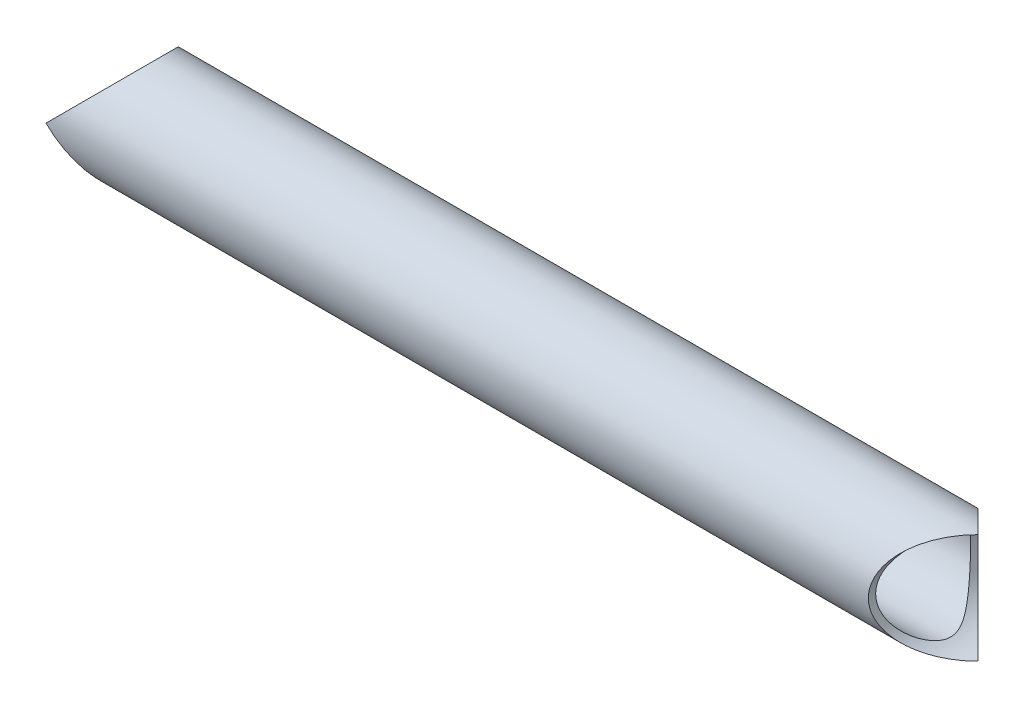
ISO-10303-21;
HEADER;
FILE_DESCRIPTION(('STEP AP214'),'2;1');
FILE_NAME('part.step','',(''),(''),'','','');
FILE_SCHEMA(('AUTOMOTIVE_DESIGN { 1 0 10303 214 1 1 1 1 }'));
ENDSEC;
DATA;
#1=APPLICATION_CONTEXT('core data for automotive mechanical design processes');
#2=APPLICATION_PROTOCOL_DEFINITION('international standard','automotive_design',2000,#1);
#3=PRODUCT_CONTEXT('',#1,'mechanical');
#4=PRODUCT('Part','Part','',(#3));
#5=PRODUCT_RELATED_PRODUCT_CATEGORY('part','',(#4));
#6=PRODUCT_DEFINITION_FORMATION('','',#4);
#7=PRODUCT_DEFINITION_CONTEXT('part definition',#1,'design');
#8=PRODUCT_DEFINITION('design','',#6,#7);
#9=PRODUCT_DEFINITION_SHAPE('','',#8);
#10=(LENGTH_UNIT() NAMED_UNIT(*) SI_UNIT(.MILLI.,.METRE.));
#11=(NAMED_UNIT(*) PLANE_ANGLE_UNIT() SI_UNIT($,.RADIAN.));
#12=(NAMED_UNIT(*) SI_UNIT($,.STERADIAN.) SOLID_ANGLE_UNIT());
#13=UNCERTAINTY_MEASURE_WITH_UNIT(LENGTH_MEASURE(1.E-05),#10,'distance_accuracy_value','');
#14=(GEOMETRIC_REPRESENTATION_CONTEXT(3) GLOBAL_UNCERTAINTY_ASSIGNED_CONTEXT((#13)) GLOBAL_UNIT_ASSIGNED_CONTEXT((#10,
#11,#12)) REPRESENTATION_CONTEXT('',''));
#15=CARTESIAN_POINT('',(0.,0.,0.));
#16=DIRECTION('',(0.,0.,1.));
#17=DIRECTION('',(1.,0.,0.));
#18=AXIS2_PLACEMENT_3D('',#15,#16,#17);
#19=CARTESIAN_POINT('',(0.,-50.7999999999999,-238.125));
#20=DIRECTION('',(0.,0.,1.));
#21=DIRECTION('',(1.,0.,0.));
#22=AXIS2_PLACEMENT_3D('',#19,#20,#21);
#23=CYLINDRICAL_SURFACE('',#22,9.52500000000001);
#24=CARTESIAN_POINT('',(0.,-50.7999999999999,0.));
#25=DIRECTION('',(0.707106781186547,0.,0.707106781186547));
#26=DIRECTION('',(0.707106781186547,0.,-0.707106781186547));
#27=AXIS2_PLACEMENT_3D('',#24,#25,#26);
#28=ELLIPSE('',#27,13.4703841816037,9.52500000000001);
#29=CARTESIAN_POINT('',(0.,-41.2749999999999,0.));
#30=VERTEX_POINT('',#29);
#31=CARTESIAN_POINT('',(0.,-60.3249999999999,0.));
#32=VERTEX_POINT('',#31);
#33=EDGE_CURVE('E52',#30,#32,#28,.T.);
#34=ORIENTED_EDGE('',*,*,#33,.T.);
#35=CARTESIAN_POINT('',(0.,-50.7999999999999,0.));
#36=DIRECTION('',(0.707106781186547,0.,-0.707106781186547));
#37=DIRECTION('',(0.707106781186547,0.,0.707106781186547));
#38=AXIS2_PLACEMENT_3D('',#35,#36,#37);
#39=ELLIPSE('',#38,13.4703841816037,9.52500000000001);
#40=EDGE_CURVE('E63',#32,#30,#39,.T.);
#41=ORIENTED_EDGE('',*,*,#40,.T.);
#42=EDGE_LOOP('',(#34,#41));
#43=FACE_BOUND('',#42,.T.);
#44=CARTESIAN_POINT('',(-9.52500000000001,-50.7999999999999,8.255));
#45=CARTESIAN_POINT('',(-9.5249991486296,-50.9937491339826,8.2549991309736));
#46=CARTESIAN_POINT('',(-9.51907602387497,-51.1875106953685,8.24816678082066));
#47=CARTESIAN_POINT('',(-9.49551993069776,-51.5733685775466,8.22096978778911));
#48=CARTESIAN_POINT('',(-9.47788593013706,-51.765464750048,8.20060395213657));
#49=CARTESIAN_POINT('',(-9.43129946891756,-52.1465057541077,8.14671669800961));
#50=CARTESIAN_POINT('',(-9.40234100660183,-52.3354488591717,8.11318830370017));
#51=CARTESIAN_POINT('',(-9.33373426055015,-52.7086741908519,8.03357968300137));
#52=CARTESIAN_POINT('',(-9.29408596924615,-52.8929564141682,7.98749944772571));
#53=CARTESIAN_POINT('',(-9.20518387045818,-53.2545172542489,7.883876820132));
#54=CARTESIAN_POINT('',(-9.15599353806632,-53.4318333182141,7.82641012090953));
#55=CARTESIAN_POINT('',(-9.04871137350907,-53.7798704421834,7.70062697305924));
#56=CARTESIAN_POINT('',(-8.99061564825056,-53.9505885767598,7.63230577878791));
#57=CARTESIAN_POINT('',(-8.86648613376941,-54.2846518823356,7.48568628536983));
#58=CARTESIAN_POINT('',(-8.80045320628408,-54.4479978510829,7.40738906925855));
#59=CARTESIAN_POINT('',(-8.66139148346519,-54.7668875740141,7.24162523096907));
#60=CARTESIAN_POINT('',(-8.5883611564381,-54.9224296085534,7.15415660082002));
#61=CARTESIAN_POINT('',(-8.40705776916901,-55.283524955091,6.93563606350434));
#62=CARTESIAN_POINT('',(-8.2960126276974,-55.4853724282805,6.80073731523924));
#63=CARTESIAN_POINT('',(-8.06474384800302,-55.8731186214091,6.51661799509541));
#64=CARTESIAN_POINT('',(-7.94451695352177,-56.0590116330817,6.36739233738682));
#65=CARTESIAN_POINT('',(-7.69694275303353,-56.4151429764073,6.05568545559861));
#66=CARTESIAN_POINT('',(-7.56957931222033,-56.5853433270331,5.89317377902937));
#67=CARTESIAN_POINT('',(-7.31032763517805,-56.9096501257252,5.55624676339447));
#68=CARTESIAN_POINT('',(-7.17844000303209,-57.063758711384,5.38183301047553));
#69=CARTESIAN_POINT('',(-6.9097312609692,-57.3591094179562,5.01788704155426));
#70=CARTESIAN_POINT('',(-6.77286471020447,-57.5000133895365,4.82811425764204));
#71=CARTESIAN_POINT('',(-6.49972297017362,-57.7653046188987,4.43682954916934));
#72=CARTESIAN_POINT('',(-6.36344798637055,-57.889686522828,4.23531384968978));
#73=CARTESIAN_POINT('',(-6.09531136489426,-58.1214833005492,3.82063329870352));
#74=CARTESIAN_POINT('',(-5.96344127621442,-58.2289323330518,3.60749309828612));
#75=CARTESIAN_POINT('',(-5.7085576305259,-58.4265298507522,3.16843181970329));
#76=CARTESIAN_POINT('',(-5.58553712092029,-58.5166920120684,2.94252102945844));
#77=CARTESIAN_POINT('',(-5.34987442057179,-58.6820035814807,2.46681442998311));
#78=CARTESIAN_POINT('',(-5.23788214298114,-58.7563666632974,2.21641466916654));
#79=CARTESIAN_POINT('',(-5.04111943195073,-58.882480743163,1.69963891728638));
#80=CARTESIAN_POINT('',(-4.95629093434719,-58.9342800592027,1.43329846759244));
#81=CARTESIAN_POINT('',(-4.86390243338432,-58.9895732626365,1.04394084534301));
#82=CARTESIAN_POINT('',(-4.83991842714101,-59.0037393928439,0.926240140688805));
#83=CARTESIAN_POINT('',(-4.80017344286406,-59.0270587846515,0.688990887447008));
#84=CARTESIAN_POINT('',(-4.78440857680631,-59.0362144165454,0.569443240153909));
#85=CARTESIAN_POINT('',(-4.761804073231,-59.0493041993866,0.329320339337253));
#86=CARTESIAN_POINT('',(-4.75495666286146,-59.0532428976971,0.208746073071864));
#87=CARTESIAN_POINT('',(-4.75048470187369,-59.055817780715,-0.0326338460710631));
#88=CARTESIAN_POINT('',(-4.75286024879907,-59.0544539093416,-0.153439501382306));
#89=CARTESIAN_POINT('',(-4.76671281142103,-59.0464620880765,-0.394165546022897));
#90=CARTESIAN_POINT('',(-4.77817607905772,-59.0398420897208,-0.51408699662208));
#91=CARTESIAN_POINT('',(-4.80965247391355,-59.0215079052453,-0.752426471254642));
#92=CARTESIAN_POINT('',(-4.82966923600084,-59.0097915533559,-0.870843834060274));
#93=CARTESIAN_POINT('',(-4.90141020066709,-58.9673081803786,-1.22310602414197));
#94=CARTESIAN_POINT('',(-4.96481146964595,-58.9292140091403,-1.45376292887399));
#95=CARTESIAN_POINT('',(-5.10130504482222,-58.8440993270653,-1.86370727584942));
#96=CARTESIAN_POINT('',(-5.17071608363495,-58.7998380394502,-2.04487996617536));
#97=CARTESIAN_POINT('',(-5.3209573168244,-58.7007056396117,-2.39953345699075));
#98=CARTESIAN_POINT('',(-5.40179537549816,-58.6458272107958,-2.57300885110598));
#99=CARTESIAN_POINT('',(-5.57175995210508,-58.5260571834299,-2.91302040075874));
#100=CARTESIAN_POINT('',(-5.66091424590647,-58.4611315145785,-3.07953040069098));
#101=CARTESIAN_POINT('',(-5.844615727875,-58.3219274665957,-3.40543837179355));
#102=CARTESIAN_POINT('',(-5.93916230476365,-58.2476501464354,-3.56483714546799));
#103=CARTESIAN_POINT('',(-6.18246639561224,-58.0483660051931,-3.9595097504533));
#104=CARTESIAN_POINT('',(-6.33346592764884,-57.9172954786953,-4.19036061822694));
#105=CARTESIAN_POINT('',(-6.63777489853474,-57.6343858364145,-4.63747538270605));
#106=CARTESIAN_POINT('',(-6.79108545677505,-57.4825363481923,-4.85373191319798));
#107=CARTESIAN_POINT('',(-7.09556835836762,-57.1582974388842,-5.27132385376016));
#108=CARTESIAN_POINT('',(-7.24674315239458,-56.9859341382319,-5.47267772045499));
#109=CARTESIAN_POINT('',(-7.54347617660777,-56.6203938688893,-5.85993838639328));
#110=CARTESIAN_POINT('',(-7.68903688542431,-56.4272262315867,-6.04585204532022));
#111=CARTESIAN_POINT('',(-7.93730120225224,-56.0688087289898,-6.35820893639366));
#112=CARTESIAN_POINT('',(-8.04190982332091,-55.9079764013749,-6.48822041734575));
#113=CARTESIAN_POINT('',(-8.24439807207299,-55.5742639895217,-6.73756594349473));
#114=CARTESIAN_POINT('',(-8.34227917360153,-55.4013865609079,-6.85690232909829));
#115=CARTESIAN_POINT('',(-8.52964066539296,-55.0439976026733,-7.08366003651123));
#116=CARTESIAN_POINT('',(-8.61913112474729,-54.8595004736176,-7.19109566852854));
#117=CARTESIAN_POINT('',(-8.78821213101058,-54.479162252312,-7.3929092417835));
#118=CARTESIAN_POINT('',(-8.86780452395288,-54.2833232853817,-7.48728961825416));
#119=CARTESIAN_POINT('',(-9.00231134156529,-53.9168967854233,-7.64607452720222));
#120=CARTESIAN_POINT('',(-9.05909739341589,-53.7480102549054,-7.7128251587236));
#121=CARTESIAN_POINT('',(-9.16395879695118,-53.4038113460863,-7.83572387058536));
#122=CARTESIAN_POINT('',(-9.21203596790862,-53.2285003190745,-7.89187416542452));
#123=CARTESIAN_POINT('',(-9.29862621941028,-52.8723757512166,-7.99277926561641));
#124=CARTESIAN_POINT('',(-9.33714258026417,-52.6915641215926,-8.03753797954925));
#125=CARTESIAN_POINT('',(-9.40388814271992,-52.325491254042,-8.11497986008865));
#126=CARTESIAN_POINT('',(-9.43211723199551,-52.1402299675534,-8.14766289484146));
#127=CARTESIAN_POINT('',(-9.47780652362301,-51.7656937772879,-8.20051181828127));
#128=CARTESIAN_POINT('',(-9.49521481683605,-51.5764039643053,-8.22061737363727));
#129=CARTESIAN_POINT('',(-9.5186628962909,-51.1961804933197,-8.24768993736896));
#130=CARTESIAN_POINT('',(-9.52470265693456,-51.0052468316163,-8.25465691616096));
#131=CARTESIAN_POINT('',(-9.52527587201026,-50.6233546852293,-8.2553183095402));
#132=CARTESIAN_POINT('',(-9.51981020342903,-50.4323962035471,-8.24901373573471));
#133=CARTESIAN_POINT('',(-9.49749861914189,-50.0520478152488,-8.22325492565544));
#134=CARTESIAN_POINT('',(-9.48065318813041,-49.8626578421735,-8.20380124943697));
#135=CARTESIAN_POINT('',(-9.43766380719514,-49.5012769873256,-8.15408122776018));
#136=CARTESIAN_POINT('',(-9.41232559052558,-49.3290593721158,-8.12475103759835));
#137=CARTESIAN_POINT('',(-9.35270884257685,-48.9882614282027,-8.05561104968291));
#138=CARTESIAN_POINT('',(-9.31842732431003,-48.8196823351416,-8.01579775061749));
#139=CARTESIAN_POINT('',(-9.2415184575641,-48.487193793368,-7.92625943872891));
#140=CARTESIAN_POINT('',(-9.19889358247869,-48.3232829771977,-7.87653736329022));
#141=CARTESIAN_POINT('',(-9.10593936756862,-48.0007724930909,-7.76777500026871));
#142=CARTESIAN_POINT('',(-9.05560715548277,-47.8421748321519,-7.70873123855649));
#143=CARTESIAN_POINT('',(-8.94374675295489,-47.5187608872484,-7.57702515132391));
#144=CARTESIAN_POINT('',(-8.88165097638804,-47.3544273551924,-7.50365911320596));
#145=CARTESIAN_POINT('',(-8.75025080214966,-47.033184711284,-7.34765599089063));
#146=CARTESIAN_POINT('',(-8.68094356792162,-46.8762785564935,-7.26501525757013));
#147=CARTESIAN_POINT('',(-8.46353025136191,-46.4172163199071,-7.00428589271632));
#148=CARTESIAN_POINT('',(-8.30591435659422,-46.1266651781981,-6.81336884998672));
#149=CARTESIAN_POINT('',(-8.01320461595648,-45.6450686935981,-6.45283278047179));
#150=CARTESIAN_POINT('',(-7.88192799380305,-45.4469871193798,-6.28928934942973));
#151=CARTESIAN_POINT('',(-7.61190373485767,-45.0695261386861,-5.94739409172999));
#152=CARTESIAN_POINT('',(-7.47315562111757,-44.8901479283049,-5.76904131931229));
#153=CARTESIAN_POINT('',(-7.19079436686113,-44.5496271092021,-5.39827838667586));
#154=CARTESIAN_POINT('',(-7.04717014783934,-44.3885302180035,-5.20583488153894));
#155=CARTESIAN_POINT('',(-6.75851614265832,-44.0849498277816,-4.80788440247805));
#156=CARTESIAN_POINT('',(-6.6134868009023,-43.9424606375919,-4.60238145150815));
#157=CARTESIAN_POINT('',(-6.35515925689207,-43.7033884965483,-4.22170022153723));
#158=CARTESIAN_POINT('',(-6.24145035992449,-43.6033825728971,-4.04894034477482));
#159=CARTESIAN_POINT('',(-6.01768753522884,-43.4152581601178,-3.69470620817143));
#160=CARTESIAN_POINT('',(-5.90763428181516,-43.3271418550521,-3.51323035552947));
#161=CARTESIAN_POINT('',(-5.69440913102355,-43.1634210663693,-3.1414680977594));
#162=CARTESIAN_POINT('',(-5.59122036896021,-43.0877851878857,-2.95120539019987));
#163=CARTESIAN_POINT('',(-5.39540026708194,-42.9495457925735,-2.56091153040391));
#164=CARTESIAN_POINT('',(-5.30276149380797,-42.8869330736752,-2.36088739974967));
#165=CARTESIAN_POINT('',(-5.11946097161144,-42.7669061216854,-1.91710109618569));
#166=CARTESIAN_POINT('',(-5.03151344556335,-42.7119475490676,-1.67147843973414));
#167=CARTESIAN_POINT('',(-4.92337591366435,-42.6459951620064,-1.29366079541494));
#168=CARTESIAN_POINT('',(-4.89130870864691,-42.6267666085471,-1.16625357807992));
#169=CARTESIAN_POINT('',(-4.83638807525044,-42.5941487008162,-0.908760812182182));
#170=CARTESIAN_POINT('',(-4.81352969366668,-42.5807562071508,-0.778676743118085));
#171=CARTESIAN_POINT('',(-4.77793189106003,-42.560010368661,-0.515053294315971));
#172=CARTESIAN_POINT('',(-4.76531560533643,-42.5527304777701,-0.381491235325645));
#173=CARTESIAN_POINT('',(-4.7513801258139,-42.5446938925531,-0.113582080058701));
#174=CARTESIAN_POINT('',(-4.7500600884271,-42.5439367111202,0.0207649568470545));
#175=CARTESIAN_POINT('',(-4.75879767507657,-42.5489701458754,0.289034938598507));
#176=CARTESIAN_POINT('',(-4.76886169242113,-42.5547644413855,0.422957602740208));
#177=CARTESIAN_POINT('',(-4.79979015185114,-42.5727311374257,0.689111683742175));
#178=CARTESIAN_POINT('',(-4.82065637679743,-42.5849045908141,0.821342817729456));
#179=CARTESIAN_POINT('',(-4.87630241943857,-42.6177934044782,1.10454643006358));
#180=CARTESIAN_POINT('',(-4.91279727603149,-42.6395786354141,1.25505528789722));
#181=CARTESIAN_POINT('',(-4.99680884433472,-42.6907499928277,1.55170325268708));
#182=CARTESIAN_POINT('',(-5.04433452044923,-42.7201423035905,1.69783869586887));
#183=CARTESIAN_POINT('',(-5.14835522742287,-42.7860211217045,1.98570912314558));
#184=CARTESIAN_POINT('',(-5.20487665227995,-42.8225285783409,2.1274296430917));
#185=CARTESIAN_POINT('',(-5.32479592263953,-42.9020660574628,2.40595811079114));
#186=CARTESIAN_POINT('',(-5.38819222241244,-42.9450946146218,2.54276715365905));
#187=CARTESIAN_POINT('',(-5.56725013397192,-43.0701689501017,2.90759118568059));
#188=CARTESIAN_POINT('',(-5.68795470478588,-43.1581634331049,3.13110425848448));
#189=CARTESIAN_POINT('',(-5.93823193042169,-43.3509689832806,3.56559758605928));
#190=CARTESIAN_POINT('',(-6.06781063001083,-43.455791579878,3.7765691114785));
#191=CARTESIAN_POINT('',(-6.33146122219588,-43.6818241898935,4.18706965610042));
#192=CARTESIAN_POINT('',(-6.46553913594528,-43.8030568804667,4.38658228698004));
#193=CARTESIAN_POINT('',(-6.73454643258557,-44.0615785090047,4.77419601105208));
#194=CARTESIAN_POINT('',(-6.86947559839105,-44.198863498402,4.96229989336767));
#195=CARTESIAN_POINT('',(-7.145629652608,-44.4984440958091,5.33822587447616));
#196=CARTESIAN_POINT('',(-7.28673552413453,-44.6617553119555,5.52532860119201));
#197=CARTESIAN_POINT('',(-7.56389432859166,-45.0067195135305,5.88601693765025));
#198=CARTESIAN_POINT('',(-7.69994627070971,-45.1883760698379,6.05959990411039));
#199=CARTESIAN_POINT('',(-7.96385928877277,-45.5696824243213,6.39160103031028));
#200=CARTESIAN_POINT('',(-8.09173780370979,-45.7692915660705,6.55005185964254));
#201=CARTESIAN_POINT('',(-8.33674937621361,-46.1866787251401,6.8504254090725));
#202=CARTESIAN_POINT('',(-8.45388734147141,-46.4044483566317,6.99235568599348));
#203=CARTESIAN_POINT('',(-8.64240803344512,-46.7917114334972,7.21895608703129));
#204=CARTESIAN_POINT('',(-8.71719498210357,-46.9568431547471,7.30828007272981));
#205=CARTESIAN_POINT('',(-8.85879069211986,-47.2955567207583,7.47660654907039));
#206=CARTESIAN_POINT('',(-8.92560141738879,-47.469136470562,7.55561158090458));
#207=CARTESIAN_POINT('',(-9.05010324269445,-47.8239988535158,7.70228991439696));
#208=CARTESIAN_POINT('',(-9.10780230457904,-48.0052745841023,7.76997311226877));
#209=CARTESIAN_POINT('',(-9.21308287307194,-48.3747956930314,7.89311833522141));
#210=CARTESIAN_POINT('',(-9.26066548891853,-48.5630403045965,7.94858170019487));
#211=CARTESIAN_POINT('',(-9.33887209356163,-48.9186537664878,8.03955174193501));
#212=CARTESIAN_POINT('',(-9.37093582182727,-49.0852716650071,8.07676302214279));
#213=CARTESIAN_POINT('',(-9.42633196678234,-49.4219587539794,8.14097036810244));
#214=CARTESIAN_POINT('',(-9.44966194236376,-49.592028895362,8.16796357789892));
#215=CARTESIAN_POINT('',(-9.48716109489852,-49.934511854833,8.21131805296772));
#216=CARTESIAN_POINT('',(-9.50133099798967,-50.1069244861208,8.22768016098987));
#217=CARTESIAN_POINT('',(-9.52024913405291,-50.4528883761126,8.24951956226246));
#218=CARTESIAN_POINT('',(-9.52500076265905,-50.6264392018054,8.2550007784753));
#219=CARTESIAN_POINT('',(-9.52500000000001,-50.7999999999999,8.255));
#220=B_SPLINE_CURVE_WITH_KNOTS('',3,(#44,#45,#46,#47,#48,#49,#50,#51,#52,#53,#54,#55,#56,#57,
#58,#59,#60,#61,#62,#63,#64,#65,#66,#67,#68,#69,#70,#71,#72,#73,#74,#75,#76,#77,#78,#79,#80,#81,
#82,#83,#84,#85,#86,#87,#88,#89,#90,#91,#92,#93,#94,#95,#96,#97,#98,#99,#100,#101,#102,#103,
#104,#105,#106,#107,#108,#109,#110,#111,#112,#113,#114,#115,#116,#117,#118,#119,#120,#121,#122,
#123,#124,#125,#126,#127,#128,#129,#130,#131,#132,#133,#134,#135,#136,#137,#138,#139,#140,#141,
#142,#143,#144,#145,#146,#147,#148,#149,#150,#151,#152,#153,#154,#155,#156,#157,#158,#159,#160,
#161,#162,#163,#164,#165,#166,#167,#168,#169,#170,#171,#172,#173,#174,#175,#176,#177,#178,#179,
#180,#181,#182,#183,#184,#185,#186,#187,#188,#189,#190,#191,#192,#193,#194,#195,#196,#197,#198,
#199,#200,#201,#202,#203,#204,#205,#206,#207,#208,#209,#210,#211,#212,#213,#214,#215,#216,#217,
#218,#219),.UNSPECIFIED.,.T.,.F.,(4,2,2,2,2,2,2,2,2,2,2,2,2,2,2,2,2,2,2,2,2,2,2,2,2,2,2,2,2,2,2,
2,2,2,2,2,2,2,2,2,2,2,2,2,2,2,2,2,2,2,2,2,2,2,2,2,2,2,2,2,2,2,2,2,2,2,2,2,2,2,2,2,2,2,2,2,2,2,2,
2,2,2,2,2,2,2,2,4),(0.,0.581060302241175,1.16217182303357,1.74359173542285,2.3250120594397,
2.90268969124199,3.48062058537873,4.05848879048121,4.63648377810278,5.43621695420251,
6.23623508026262,7.03814127970887,7.83994081992868,8.65857780584581,9.47747942119572,
10.2947073130676,11.1112859813718,11.9620431912298,12.8109695269324,13.1734956172864,
13.5358500604877,13.8978884475344,14.2599306635729,14.6214262186982,14.9830755469358,
15.7069631447091,16.3031815010826,16.89981220255,17.498512307486,18.0971446771324,
19.0121600805804,19.9276339189251,20.8419543021521,21.7558662790184,22.4505614625091,
23.1451039659047,23.8388020282264,24.5323705181272,25.102627506706,25.6727652316906,
26.2427070714557,26.8126551342036,27.3853166471829,27.9579794496038,28.5305986031097,
29.1031933687764,29.6321866176357,30.1613567724987,30.6903702914558,31.2195814376324,
31.7901536941554,32.360951234249,33.5023725912858,34.3667872613037,35.2312571774338,
36.097843397763,36.9641639487798,37.6529096955542,38.3417817896671,39.0288936791848,
39.715518398605,40.512573766315,40.9105237639805,41.3082594272077,41.7107088469781,
42.1131282121321,42.5157736890733,42.918485642225,43.38692566356,43.8557477127695,
44.32597156752,44.7960899166667,45.6013224389748,46.4071090223581,47.2140207141777,
48.020734336611,48.8767355197429,49.732903643882,50.5871794481831,51.4410629415441,
52.0468024868874,52.6523925776822,53.2574505352097,53.862442115674,54.3830405578493,
54.9037844002805,55.4244869572118,55.9450017475653),.UNSPECIFIED.);
#221=CARTESIAN_POINT('',(-9.52500000000001,-50.7999999999999,8.255));
#222=VERTEX_POINT('',#221);
#223=EDGE_CURVE('E68',#222,#222,#220,.T.);
#224=ORIENTED_EDGE('',*,*,#223,.F.);
#225=EDGE_LOOP('',(#224));
#226=FACE_BOUND('',#225,.T.);
#227=ADVANCED_FACE('F33',(#43,#226),#23,.F.);
#228=CARTESIAN_POINT('',(-152.4,-238.125,0.));
#229=DIRECTION('',(0.,1.,0.));
#230=DIRECTION('',(0.,0.,1.));
#231=AXIS2_PLACEMENT_3D('',#228,#229,#230);
#232=CYLINDRICAL_SURFACE('',#231,9.525);
#233=CARTESIAN_POINT('',(-152.4,-50.8,0.));
#234=DIRECTION('',(0.707106781186547,0.707106781186547,0.));
#235=DIRECTION('',(0.707106781186547,-0.707106781186547,0.));
#236=AXIS2_PLACEMENT_3D('',#233,#234,#235);
#237=ELLIPSE('',#236,13.4703841816037,9.525);
#238=CARTESIAN_POINT('',(-152.4,-50.8,-9.52499999999996));
#239=VERTEX_POINT('',#238);
#240=CARTESIAN_POINT('',(-152.4,-50.7999999999999,9.52500000000002));
#241=VERTEX_POINT('',#240);
#242=EDGE_CURVE('E11',#239,#241,#237,.F.);
#243=ORIENTED_EDGE('',*,*,#242,.T.);
#244=CARTESIAN_POINT('',(-152.4,-50.8,0.));
#245=DIRECTION('',(0.707106781186547,-0.707106781186547,0.));
#246=DIRECTION('',(0.707106781186547,0.707106781186547,0.));
#247=AXIS2_PLACEMENT_3D('',#244,#245,#246);
#248=ELLIPSE('',#247,13.4703841816037,9.525);
#249=EDGE_CURVE('E41',#241,#239,#248,.F.);
#250=ORIENTED_EDGE('',*,*,#249,.T.);
#251=EDGE_LOOP('',(#243,#250));
#252=FACE_BOUND('',#251,.T.);
#253=CARTESIAN_POINT('',(-142.875,-59.055,0.));
#254=CARTESIAN_POINT('',(-142.87500085137,-59.0549991309736,0.19374913398273));
#255=CARTESIAN_POINT('',(-142.880923976125,-59.0481667808206,0.387510695368571));
#256=CARTESIAN_POINT('',(-142.904480069302,-59.0209697877891,0.77336857754672));
#257=CARTESIAN_POINT('',(-142.922114069863,-59.0006039521365,0.965464750048058));
#258=CARTESIAN_POINT('',(-142.968700531082,-58.9467166980096,1.34650575410774));
#259=CARTESIAN_POINT('',(-142.997658993398,-58.9131883037001,1.53544885917175));
#260=CARTESIAN_POINT('',(-143.06626573945,-58.8335796830013,1.90867419085194));
#261=CARTESIAN_POINT('',(-143.105914030754,-58.7874994477257,2.09295641416825));
#262=CARTESIAN_POINT('',(-143.194816129542,-58.6838768201319,2.45451725424899));
#263=CARTESIAN_POINT('',(-143.244006461934,-58.6264101209095,2.63183331821417));
#264=CARTESIAN_POINT('',(-143.351288626491,-58.5006269730592,2.97987044218349));
#265=CARTESIAN_POINT('',(-143.409384351749,-58.4323057787878,3.15058857675984));
#266=CARTESIAN_POINT('',(-143.533513866231,-58.2856862853698,3.4846518823357));
#267=CARTESIAN_POINT('',(-143.599546793716,-58.2073890692585,3.64799785108299));
#268=CARTESIAN_POINT('',(-143.738608516535,-58.041625230969,3.96688757401422));
#269=CARTESIAN_POINT('',(-143.811638843562,-57.95415660082,4.12242960855345));
#270=CARTESIAN_POINT('',(-143.992942230831,-57.7356360635043,4.4835249550911));
#271=CARTESIAN_POINT('',(-144.103987372303,-57.6007373152392,4.68537242828057));
#272=CARTESIAN_POINT('',(-144.335256151997,-57.3166179950954,5.07311862140914));
#273=CARTESIAN_POINT('',(-144.455483046478,-57.1673923373868,5.25901163308177));
#274=CARTESIAN_POINT('',(-144.703057246966,-56.8556854555985,5.61514297640733));
#275=CARTESIAN_POINT('',(-144.83042068778,-56.6931737790293,5.78534332703317));
#276=CARTESIAN_POINT('',(-145.089672364822,-56.3562467633944,6.10965012572531));
#277=CARTESIAN_POINT('',(-145.221559996968,-56.1818330104755,6.26375871138407));
#278=CARTESIAN_POINT('',(-145.490268739031,-55.8178870415542,6.55910941795629));
#279=CARTESIAN_POINT('',(-145.627135289795,-55.628114257642,6.70001338953652));
#280=CARTESIAN_POINT('',(-145.900277029826,-55.2368295491693,6.96530461889882));
#281=CARTESIAN_POINT('',(-146.036552013629,-55.0353138496897,7.08968652282802));
#282=CARTESIAN_POINT('',(-146.304688635106,-54.6206332987035,7.32148330054927));
#283=CARTESIAN_POINT('',(-146.436558723786,-54.407493098286,7.42893233305185));
#284=CARTESIAN_POINT('',(-146.691442369474,-53.9684318197032,7.62652985075222));
#285=CARTESIAN_POINT('',(-146.81446287908,-53.7425210294584,7.71669201206844));
#286=CARTESIAN_POINT('',(-147.050125579428,-53.266814429983,7.88200358148075));
#287=CARTESIAN_POINT('',(-147.162117857019,-53.0164146691664,7.95636666329745));
#288=CARTESIAN_POINT('',(-147.358880568049,-52.4996389172863,8.08248074316305));
#289=CARTESIAN_POINT('',(-147.443709065653,-52.2332984675923,8.13428005920272));
#290=CARTESIAN_POINT('',(-147.536097566616,-51.8439408453429,8.18957326263655));
#291=CARTESIAN_POINT('',(-147.560081572859,-51.7262401406887,8.20373939284398));
#292=CARTESIAN_POINT('',(-147.599826557136,-51.4889908874469,8.22705878465156));
#293=CARTESIAN_POINT('',(-147.615591423194,-51.3694432401538,8.23621441654547));
#294=CARTESIAN_POINT('',(-147.638195926769,-51.1293203393371,8.2493041993867));
#295=CARTESIAN_POINT('',(-147.645043337138,-51.0087460730717,8.25324289769713));
#296=CARTESIAN_POINT('',(-147.649515298126,-50.7673661539288,8.25581778071505));
#297=CARTESIAN_POINT('',(-147.647139751201,-50.6465604986176,8.25445390934165));
#298=CARTESIAN_POINT('',(-147.633287188579,-50.405834453977,8.24646208807653));
#299=CARTESIAN_POINT('',(-147.621823920942,-50.2859130033778,8.23984208972089));
#300=CARTESIAN_POINT('',(-147.590347526086,-50.0475735287452,8.22150790524537));
#301=CARTESIAN_POINT('',(-147.570330763999,-49.9291561659396,8.20979155335592));
#302=CARTESIAN_POINT('',(-147.498589799333,-49.5768939758579,8.1673081803786));
#303=CARTESIAN_POINT('',(-147.435188530354,-49.3462370711259,8.12921400914038));
#304=CARTESIAN_POINT('',(-147.298694955178,-48.9362927241504,8.04409932706531));
#305=CARTESIAN_POINT('',(-147.229283916365,-48.7551200338245,7.99983803945019));
#306=CARTESIAN_POINT('',(-147.079042683175,-48.4004665430091,7.90070563961169));
#307=CARTESIAN_POINT('',(-146.998204624502,-48.2269911488938,7.84582721079578));
#308=CARTESIAN_POINT('',(-146.828240047895,-47.8869795992411,7.72605718342984));
#309=CARTESIAN_POINT('',(-146.739085754093,-47.7204695993088,7.66113151457848));
#310=CARTESIAN_POINT('',(-146.555384272125,-47.3945616282062,7.52192746659572));
#311=CARTESIAN_POINT('',(-146.460837695236,-47.2351628545318,7.4476501464354));
#312=CARTESIAN_POINT('',(-146.217533604388,-46.8404902495465,7.24836600519302));
#313=CARTESIAN_POINT('',(-146.066534072351,-46.6096393817729,7.11729547869527));
#314=CARTESIAN_POINT('',(-145.762225101465,-46.1625246172938,6.83438583641441));
#315=CARTESIAN_POINT('',(-145.608914543225,-45.9462680868018,6.6825363481922));
#316=CARTESIAN_POINT('',(-145.304431641632,-45.5286761462397,6.35829743888411));
#317=CARTESIAN_POINT('',(-145.153256847605,-45.3273222795448,6.18593413823187));
#318=CARTESIAN_POINT('',(-144.856523823392,-44.9400616136066,5.82039386888926));
#319=CARTESIAN_POINT('',(-144.710963114576,-44.7541479546796,5.62722623158657));
#320=CARTESIAN_POINT('',(-144.462698797748,-44.4417910636062,5.26880872898973));
#321=CARTESIAN_POINT('',(-144.358090176679,-44.3117795826541,5.10797640137479));
#322=CARTESIAN_POINT('',(-144.155601927927,-44.0624340565051,4.77426398952161));
#323=CARTESIAN_POINT('',(-144.057720826398,-43.9430976709016,4.60138656090782));
#324=CARTESIAN_POINT('',(-143.870359334607,-43.7163399634886,4.24399760267325));
#325=CARTESIAN_POINT('',(-143.780868875253,-43.6089043314713,4.05950047361752));
#326=CARTESIAN_POINT('',(-143.611787868989,-43.4070907582164,3.67916225231195));
#327=CARTESIAN_POINT('',(-143.532195476047,-43.3127103817457,3.48332328538161));
#328=CARTESIAN_POINT('',(-143.397688658435,-43.1539254727977,3.11689678542319));
#329=CARTESIAN_POINT('',(-143.340902606584,-43.0871748412763,2.94801025490531));
#330=CARTESIAN_POINT('',(-143.236041203049,-42.9642761294146,2.60381134608625));
#331=CARTESIAN_POINT('',(-143.187964032091,-42.9081258345754,2.42850031907443));
#332=CARTESIAN_POINT('',(-143.10137378059,-42.8072207343835,2.07237575121654));
#333=CARTESIAN_POINT('',(-143.062857419736,-42.7624620204507,1.89156412159253));
#334=CARTESIAN_POINT('',(-142.99611185728,-42.6850201399113,1.52549125404195));
#335=CARTESIAN_POINT('',(-142.967882768004,-42.6523371051585,1.34022996755332));
#336=CARTESIAN_POINT('',(-142.922193476377,-42.5994881817187,0.965693777287854));
#337=CARTESIAN_POINT('',(-142.904785183164,-42.5793826263627,0.776403964305246));
#338=CARTESIAN_POINT('',(-142.881337103709,-42.552310062631,0.396180493319646));
#339=CARTESIAN_POINT('',(-142.875297343065,-42.545343083839,0.205246831616227));
#340=CARTESIAN_POINT('',(-142.87472412799,-42.5446816904598,-0.176645314770734));
#341=CARTESIAN_POINT('',(-142.880189796571,-42.5509862642653,-0.367603796452989));
#342=CARTESIAN_POINT('',(-142.902501380858,-42.5767450743445,-0.747952184751305));
#343=CARTESIAN_POINT('',(-142.91934681187,-42.596198750563,-0.937342157826568));
#344=CARTESIAN_POINT('',(-142.962336192805,-42.6459187722398,-1.29872301267452));
#345=CARTESIAN_POINT('',(-142.987674409474,-42.6752489624016,-1.47094062788432));
#346=CARTESIAN_POINT('',(-143.047291157423,-42.7443889503171,-1.81173857179739));
#347=CARTESIAN_POINT('',(-143.08157267569,-42.7842022493825,-1.98031766485847));
#348=CARTESIAN_POINT('',(-143.158481542436,-42.8737405612711,-2.31280620663206));
#349=CARTESIAN_POINT('',(-143.201106417521,-42.9234626367098,-2.47671702280237));
#350=CARTESIAN_POINT('',(-143.294060632431,-43.0322249997313,-2.7992275069092));
#351=CARTESIAN_POINT('',(-143.344392844517,-43.0912687614435,-2.9578251678482));
#352=CARTESIAN_POINT('',(-143.456253247045,-43.2229748486761,-3.2812391127516));
#353=CARTESIAN_POINT('',(-143.518349023612,-43.296340886794,-3.44557264480764));
#354=CARTESIAN_POINT('',(-143.64974919785,-43.4523440091094,-3.76681528871603));
#355=CARTESIAN_POINT('',(-143.719056432079,-43.5349847424299,-3.92372144350654));
#356=CARTESIAN_POINT('',(-143.936469748638,-43.7957141072837,-4.38278368009291));
#357=CARTESIAN_POINT('',(-144.094085643406,-43.9866311500133,-4.67333482180195));
#358=CARTESIAN_POINT('',(-144.386795384044,-44.3471672195283,-5.15493130640193));
#359=CARTESIAN_POINT('',(-144.518072006197,-44.5107106505703,-5.35301288062021));
#360=CARTESIAN_POINT('',(-144.788096265142,-44.85260590827,-5.73047386131397));
#361=CARTESIAN_POINT('',(-144.926844378883,-45.0309586806878,-5.90985207169516));
#362=CARTESIAN_POINT('',(-145.209205633139,-45.4017216133242,-6.25037289079792));
#363=CARTESIAN_POINT('',(-145.352829852161,-45.5941651184611,-6.4114697819965));
#364=CARTESIAN_POINT('',(-145.641483857342,-45.992115597522,-6.71505017221842));
#365=CARTESIAN_POINT('',(-145.786513199098,-46.1976185484919,-6.85753936240814));
#366=CARTESIAN_POINT('',(-146.044840743108,-46.5782997784628,-7.09661150345167));
#367=CARTESIAN_POINT('',(-146.158549640076,-46.7510596552253,-7.19661742710295));
#368=CARTESIAN_POINT('',(-146.382312464771,-47.1052937918286,-7.38474183988223));
#369=CARTESIAN_POINT('',(-146.492365718185,-47.2867696444706,-7.4728581449479));
#370=CARTESIAN_POINT('',(-146.705590868977,-47.6585319022406,-7.63657893363069));
#371=CARTESIAN_POINT('',(-146.80877963104,-47.8487946098002,-7.71221481211432));
#372=CARTESIAN_POINT('',(-147.004599732918,-48.2390884695961,-7.85045420742642));
#373=CARTESIAN_POINT('',(-147.097238506192,-48.4391126002503,-7.91306692632472));
#374=CARTESIAN_POINT('',(-147.280539028389,-48.8828989038143,-8.03309387831454));
#375=CARTESIAN_POINT('',(-147.368486554437,-49.1285215602658,-8.08805245093232));
#376=CARTESIAN_POINT('',(-147.476624086336,-49.506339204585,-8.15400483799359));
#377=CARTESIAN_POINT('',(-147.508691291353,-49.63374642192,-8.17323339145289));
#378=CARTESIAN_POINT('',(-147.56361192475,-49.8912391878178,-8.20585129918379));
#379=CARTESIAN_POINT('',(-147.586470306333,-50.0213232568819,-8.21924379284914));
#380=CARTESIAN_POINT('',(-147.62206810894,-50.284946705684,-8.23998963133893));
#381=CARTESIAN_POINT('',(-147.634684394664,-50.4185087646743,-8.24726952222987));
#382=CARTESIAN_POINT('',(-147.648619874186,-50.6864179199412,-8.25530610744689));
#383=CARTESIAN_POINT('',(-147.649939911573,-50.820764956847,-8.25606328887974));
#384=CARTESIAN_POINT('',(-147.641202324924,-51.0890349385984,-8.25102985412451));
#385=CARTESIAN_POINT('',(-147.631138307579,-51.2229576027401,-8.24523555861444));
#386=CARTESIAN_POINT('',(-147.600209848149,-51.4891116837421,-8.2272688625743));
#387=CARTESIAN_POINT('',(-147.579343623203,-51.6213428177294,-8.21509540918585));
#388=CARTESIAN_POINT('',(-147.523697580562,-51.9045464300635,-8.18220659552175));
#389=CARTESIAN_POINT('',(-147.487202723969,-52.0550552878971,-8.16042136458584));
#390=CARTESIAN_POINT('',(-147.403191155665,-52.351703252687,-8.10925000717226));
#391=CARTESIAN_POINT('',(-147.355665479551,-52.4978386958688,-8.0798576964095));
#392=CARTESIAN_POINT('',(-147.251644772577,-52.7857091231455,-8.01397887829546));
#393=CARTESIAN_POINT('',(-147.19512334772,-52.9274296430916,-7.97747142165909));
#394=CARTESIAN_POINT('',(-147.075204077361,-53.205958110791,-7.89793394253723));
#395=CARTESIAN_POINT('',(-147.011807777588,-53.3427671536589,-7.85490538537823));
#396=CARTESIAN_POINT('',(-146.832749866028,-53.7075911856804,-7.72983104989832));
#397=CARTESIAN_POINT('',(-146.712045295214,-53.9311042584843,-7.64183656689507));
#398=CARTESIAN_POINT('',(-146.461768069579,-54.3655975860591,-7.44903101671945));
#399=CARTESIAN_POINT('',(-146.332189369989,-54.5765691114783,-7.344208420122));
#400=CARTESIAN_POINT('',(-146.068538777804,-54.9870696561003,-7.11817581010657));
#401=CARTESIAN_POINT('',(-145.934460864055,-55.1865822869799,-6.99694311953335));
#402=CARTESIAN_POINT('',(-145.665453567415,-55.5741960110519,-6.73842149099533));
#403=CARTESIAN_POINT('',(-145.530524401609,-55.7622998933675,-6.60113650159807));
#404=CARTESIAN_POINT('',(-145.254370347392,-56.138225874476,-6.30155590419091));
#405=CARTESIAN_POINT('',(-145.113264475866,-56.3253286011918,-6.13824468804453));
#406=CARTESIAN_POINT('',(-144.836105671409,-56.6860169376501,-5.79328048646956));
#407=CARTESIAN_POINT('',(-144.70005372929,-56.8595999041102,-5.61162393016222));
#408=CARTESIAN_POINT('',(-144.436140711227,-57.1916010303101,-5.2303175756788));
#409=CARTESIAN_POINT('',(-144.30826219629,-57.3500518596424,-5.03070843392959));
#410=CARTESIAN_POINT('',(-144.063250623787,-57.6504254090724,-4.61332127485999));
#411=CARTESIAN_POINT('',(-143.946112658529,-57.7923556859933,-4.39555164336836));
#412=CARTESIAN_POINT('',(-143.757591966555,-58.0189560870312,-4.00828856650293));
#413=CARTESIAN_POINT('',(-143.682805017897,-58.1082800727297,-3.84315684525302));
#414=CARTESIAN_POINT('',(-143.54120930788,-58.2766065490703,-3.50444327924182));
#415=CARTESIAN_POINT('',(-143.474398582611,-58.3556115809045,-3.33086352943809));
#416=CARTESIAN_POINT('',(-143.349896757306,-58.5022899143968,-2.97600114648433));
#417=CARTESIAN_POINT('',(-143.292197695421,-58.5699731122687,-2.7947254158978));
#418=CARTESIAN_POINT('',(-143.186917126928,-58.6931183352213,-2.42520430696873));
#419=CARTESIAN_POINT('',(-143.139334511082,-58.7485817001948,-2.23695969540359));
#420=CARTESIAN_POINT('',(-143.061127906438,-58.8395517419349,-1.88134623351235));
#421=CARTESIAN_POINT('',(-143.029064178173,-58.8767630221427,-1.71472833499298));
#422=CARTESIAN_POINT('',(-142.973668033218,-58.9409703681024,-1.37804124602062));
#423=CARTESIAN_POINT('',(-142.950338057636,-58.9679635778989,-1.20797110463804));
#424=CARTESIAN_POINT('',(-142.912838905102,-59.0113180529677,-0.865488145167034));
#425=CARTESIAN_POINT('',(-142.89866900201,-59.0276801609898,-0.693075513879193));
#426=CARTESIAN_POINT('',(-142.879750865947,-59.0495195622624,-0.347111623887323));
#427=CARTESIAN_POINT('',(-142.874999237341,-59.0550007784753,-0.173560798194559));
#428=CARTESIAN_POINT('',(-142.875,-59.055,0.));
#429=B_SPLINE_CURVE_WITH_KNOTS('',3,(#253,#254,#255,#256,#257,#258,#259,#260,#261,#262,#263,
#264,#265,#266,#267,#268,#269,#270,#271,#272,#273,#274,#275,#276,#277,#278,#279,#280,#281,#282,
#283,#284,#285,#286,#287,#288,#289,#290,#291,#292,#293,#294,#295,#296,#297,#298,#299,#300,#301,
#302,#303,#304,#305,#306,#307,#308,#309,#310,#311,#312,#313,#314,#315,#316,#317,#318,#319,#320,
#321,#322,#323,#324,#325,#326,#327,#328,#329,#330,#331,#332,#333,#334,#335,#336,#337,#338,#339,
#340,#341,#342,#343,#344,#345,#346,#347,#348,#349,#350,#351,#352,#353,#354,#355,#356,#357,#358,
#359,#360,#361,#362,#363,#364,#365,#366,#367,#368,#369,#370,#371,#372,#373,#374,#375,#376,#377,
#378,#379,#380,#381,#382,#383,#384,#385,#386,#387,#388,#389,#390,#391,#392,#393,#394,#395,#396,
#397,#398,#399,#400,#401,#402,#403,#404,#405,#406,#407,#408,#409,#410,#411,#412,#413,#414,#415,
#416,#417,#418,#419,#420,#421,#422,#423,#424,#425,#426,#427,#428),.UNSPECIFIED.,.T.,.F.,(4,2,2,
2,2,2,2,2,2,2,2,2,2,2,2,2,2,2,2,2,2,2,2,2,2,2,2,2,2,2,2,2,2,2,2,2,2,2,2,2,2,2,2,2,2,2,2,2,2,2,2,
2,2,2,2,2,2,2,2,2,2,2,2,2,2,2,2,2,2,2,2,2,2,2,2,2,2,2,2,2,2,2,2,2,2,2,2,4),(0.,0.58106030224117,
1.16217182303357,1.74359173542285,2.3250120594397,2.90268969124198,3.48062058537872,
4.0584887904812,4.63648377810277,5.43621695420249,6.23623508026261,7.03814127970884,
7.83994081992867,8.65857780584578,9.47747942119568,10.2947073130676,11.1112859813718,
11.9620431912298,12.8109695269324,13.1734956172864,13.5358500604877,13.8978884475344,
14.2599306635729,14.6214262186982,14.9830755469358,15.7069631447091,16.3031815010827,
16.8998122025501,17.4985123074861,18.0971446771325,19.0121600805806,19.9276339189252,
20.8419543021522,21.7558662790185,22.4505614625092,23.1451039659048,23.8388020282265,
24.5323705181272,25.102627506706,25.6727652316906,26.2427070714557,26.8126551342037,
27.3853166471829,27.9579794496038,28.5305986031097,29.1031933687764,29.6321866176357,
30.1613567724987,30.6903702914558,31.2195814376324,31.7901536941554,32.360951234249,
33.5023725912858,34.3667872613037,35.2312571774338,36.0978433977631,36.9641639487799,
37.6529096955542,38.3417817896671,39.0288936791848,39.7155183986049,40.5125737663149,
40.9105237639804,41.3082594272076,41.710708846978,42.1131282121321,42.5157736890732,
42.9184856422248,43.3869256635599,43.8557477127694,44.3259715675198,44.7960899166665,
45.6013224389746,46.4071090223579,47.2140207141775,48.0207343366107,48.8767355197427,
49.7329036438818,50.5871794481829,51.4410629415438,52.0468024868872,52.652392577682,
53.2574505352095,53.8624421156739,54.3830405578491,54.9037844002804,55.4244869572118,
55.9450017475653),.UNSPECIFIED.);
#430=CARTESIAN_POINT('',(-142.875,-59.055,0.));
#431=VERTEX_POINT('',#430);
#432=EDGE_CURVE('E65',#431,#431,#429,.T.);
#433=ORIENTED_EDGE('',*,*,#432,.F.);
#434=EDGE_LOOP('',(#433));
#435=FACE_BOUND('',#434,.T.);
#436=ADVANCED_FACE('F57',(#252,#435),#232,.F.);
#437=CARTESIAN_POINT('',(-152.4,-50.8,0.));
#438=DIRECTION('',(1.,0.,0.));
#439=DIRECTION('',(0.,1.,0.));
#440=AXIS2_PLACEMENT_3D('',#437,#438,#439);
#441=CYLINDRICAL_SURFACE('',#440,9.525);
#442=ORIENTED_EDGE('',*,*,#242,.F.);
#443=ORIENTED_EDGE('',*,*,#249,.F.);
#444=EDGE_LOOP('',(#442,#443));
#445=FACE_BOUND('',#444,.T.);
#446=ORIENTED_EDGE('',*,*,#33,.F.);
#447=ORIENTED_EDGE('',*,*,#40,.F.);
#448=EDGE_LOOP('',(#446,#447));
#449=FACE_BOUND('',#448,.T.);
#450=ADVANCED_FACE('F35',(#445,#449),#441,.T.);
#451=CARTESIAN_POINT('',(-152.4,-50.8,0.));
#452=DIRECTION('',(1.,0.,0.));
#453=DIRECTION('',(0.,1.,0.));
#454=AXIS2_PLACEMENT_3D('',#451,#452,#453);
#455=CYLINDRICAL_SURFACE('',#454,8.255);
#456=ORIENTED_EDGE('',*,*,#432,.T.);
#457=EDGE_LOOP('',(#456));
#458=FACE_BOUND('',#457,.T.);
#459=ORIENTED_EDGE('',*,*,#223,.T.);
#460=EDGE_LOOP('',(#459));
#461=FACE_BOUND('',#460,.T.);
#462=ADVANCED_FACE('F62',(#458,#461),#455,.F.);
#463=CLOSED_SHELL('',(#227,#436,#450,#462));
#464=MANIFOLD_SOLID_BREP('B2',#463);
#465=ADVANCED_BREP_SHAPE_REPRESENTATION('',(#18,#464),#14);
#466=SHAPE_DEFINITION_REPRESENTATION(#9,#465);
ENDSEC;
END-ISO-10303-21;
